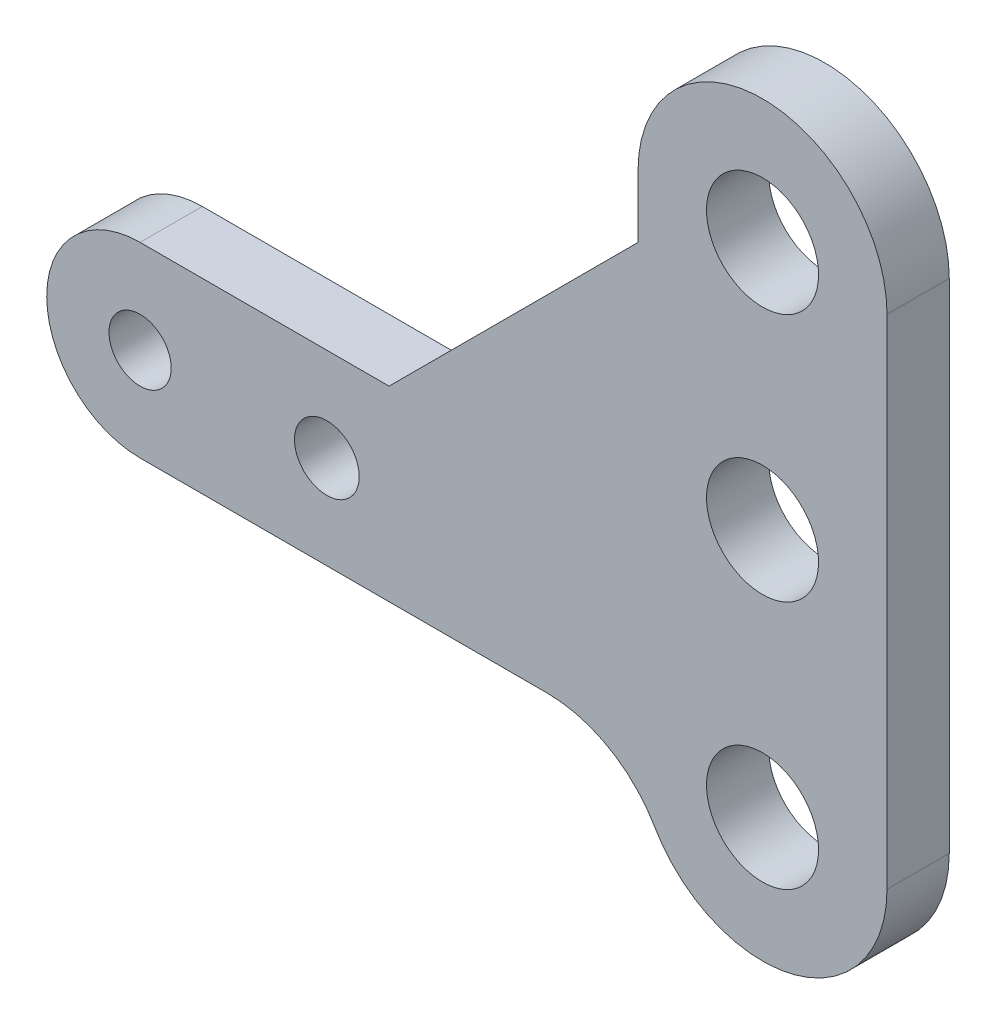
ISO-10303-21;
HEADER;
FILE_DESCRIPTION(('STEP AP214'),'2;1');
FILE_NAME('part.step','',(''),(''),'','','');
FILE_SCHEMA(('AUTOMOTIVE_DESIGN { 1 0 10303 214 1 1 1 1 }'));
ENDSEC;
DATA;
#1=APPLICATION_CONTEXT('core data for automotive mechanical design processes');
#2=APPLICATION_PROTOCOL_DEFINITION('international standard','automotive_design',2000,#1);
#3=PRODUCT_CONTEXT('',#1,'mechanical');
#4=PRODUCT('Part','Part','',(#3));
#5=PRODUCT_RELATED_PRODUCT_CATEGORY('part','',(#4));
#6=PRODUCT_DEFINITION_FORMATION('','',#4);
#7=PRODUCT_DEFINITION_CONTEXT('part definition',#1,'design');
#8=PRODUCT_DEFINITION('design','',#6,#7);
#9=PRODUCT_DEFINITION_SHAPE('','',#8);
#10=(LENGTH_UNIT() NAMED_UNIT(*) SI_UNIT(.MILLI.,.METRE.));
#11=(NAMED_UNIT(*) PLANE_ANGLE_UNIT() SI_UNIT($,.RADIAN.));
#12=(NAMED_UNIT(*) SI_UNIT($,.STERADIAN.) SOLID_ANGLE_UNIT());
#13=UNCERTAINTY_MEASURE_WITH_UNIT(LENGTH_MEASURE(1.E-05),#10,'distance_accuracy_value','');
#14=(GEOMETRIC_REPRESENTATION_CONTEXT(3) GLOBAL_UNCERTAINTY_ASSIGNED_CONTEXT((#13)) GLOBAL_UNIT_ASSIGNED_CONTEXT((#10,
#11,#12)) REPRESENTATION_CONTEXT('',''));
#15=CARTESIAN_POINT('',(0.,0.,0.));
#16=DIRECTION('',(0.,0.,1.));
#17=DIRECTION('',(1.,0.,0.));
#18=AXIS2_PLACEMENT_3D('',#15,#16,#17);
#19=CARTESIAN_POINT('',(-15.,0.,-5.));
#20=DIRECTION('',(0.,0.,1.));
#21=DIRECTION('',(1.,0.,0.));
#22=AXIS2_PLACEMENT_3D('',#19,#20,#21);
#23=CYLINDRICAL_SURFACE('',#22,7.5);
#24=CARTESIAN_POINT('',(-15.,0.,0.));
#25=DIRECTION('',(0.,0.,1.));
#26=DIRECTION('',(1.,0.,0.));
#27=AXIS2_PLACEMENT_3D('',#24,#25,#26);
#28=CIRCLE('',#27,7.5);
#29=CARTESIAN_POINT('',(-15.,7.5,0.));
#30=VERTEX_POINT('',#29);
#31=CARTESIAN_POINT('',(-15.,-7.5,0.));
#32=VERTEX_POINT('',#31);
#33=EDGE_CURVE('E153',#30,#32,#28,.T.);
#34=ORIENTED_EDGE('',*,*,#33,.F.);
#35=DIRECTION('',(0.,0.,1.));
#36=VECTOR('',#35,1.);
#37=CARTESIAN_POINT('',(-15.,7.5,-5.));
#38=LINE('',#37,#36);
#39=CARTESIAN_POINT('',(-15.,7.5,-5.));
#40=VERTEX_POINT('',#39);
#41=EDGE_CURVE('E133',#40,#30,#38,.T.);
#42=ORIENTED_EDGE('',*,*,#41,.F.);
#43=CARTESIAN_POINT('',(-15.,0.,-5.));
#44=DIRECTION('',(0.,0.,1.));
#45=DIRECTION('',(1.,0.,0.));
#46=AXIS2_PLACEMENT_3D('',#43,#44,#45);
#47=CIRCLE('',#46,7.5);
#48=CARTESIAN_POINT('',(-15.,-7.5,-5.));
#49=VERTEX_POINT('',#48);
#50=EDGE_CURVE('E127',#40,#49,#47,.T.);
#51=ORIENTED_EDGE('',*,*,#50,.T.);
#52=DIRECTION('',(0.,0.,1.));
#53=VECTOR('',#52,1.);
#54=CARTESIAN_POINT('',(-15.,-7.5,-5.));
#55=LINE('',#54,#53);
#56=EDGE_CURVE('E109',#49,#32,#55,.T.);
#57=ORIENTED_EDGE('',*,*,#56,.T.);
#58=EDGE_LOOP('',(#34,#42,#51,#57));
#59=FACE_BOUND('',#58,.T.);
#60=ADVANCED_FACE('F40',(#59),#23,.T.);
#61=CARTESIAN_POINT('',(-15.,7.5,-5.));
#62=DIRECTION('',(0.,1.,0.));
#63=DIRECTION('',(0.,0.,1.));
#64=AXIS2_PLACEMENT_3D('',#61,#62,#63);
#65=PLANE('',#64);
#66=DIRECTION('',(-1.,0.,0.));
#67=VECTOR('',#66,1.);
#68=CARTESIAN_POINT('',(-15.,7.5,0.));
#69=LINE('',#68,#67);
#70=CARTESIAN_POINT('',(5.00000000000011,7.5,0.));
#71=VERTEX_POINT('',#70);
#72=EDGE_CURVE('E134',#71,#30,#69,.T.);
#73=ORIENTED_EDGE('',*,*,#72,.F.);
#74=DIRECTION('',(0.,0.,-1.));
#75=VECTOR('',#74,1.);
#76=CARTESIAN_POINT('',(5.00000000000011,7.5,-5.));
#77=LINE('',#76,#75);
#78=CARTESIAN_POINT('',(5.00000000000011,7.5,-5.));
#79=VERTEX_POINT('',#78);
#80=EDGE_CURVE('E177',#71,#79,#77,.T.);
#81=ORIENTED_EDGE('',*,*,#80,.T.);
#82=DIRECTION('',(-1.,0.,0.));
#83=VECTOR('',#82,1.);
#84=CARTESIAN_POINT('',(25.,7.5,-5.));
#85=LINE('',#84,#83);
#86=EDGE_CURVE('E121',#79,#40,#85,.T.);
#87=ORIENTED_EDGE('',*,*,#86,.T.);
#88=ORIENTED_EDGE('',*,*,#41,.T.);
#89=EDGE_LOOP('',(#73,#81,#87,#88));
#90=FACE_BOUND('',#89,.T.);
#91=ADVANCED_FACE('F190',(#90),#65,.T.);
#92=CARTESIAN_POINT('',(25.,32.5,-5.));
#93=DIRECTION('',(-1.,0.,0.));
#94=DIRECTION('',(0.,-1.,0.));
#95=AXIS2_PLACEMENT_3D('',#92,#93,#94);
#96=PLANE('',#95);
#97=DIRECTION('',(0.,-1.,0.));
#98=VECTOR('',#97,1.);
#99=CARTESIAN_POINT('',(25.,32.5,-5.));
#100=LINE('',#99,#98);
#101=CARTESIAN_POINT('',(25.,32.5,-5.));
#102=VERTEX_POINT('',#101);
#103=CARTESIAN_POINT('',(25.,27.5000000000001,-5.));
#104=VERTEX_POINT('',#103);
#105=EDGE_CURVE('E149',#102,#104,#100,.T.);
#106=ORIENTED_EDGE('',*,*,#105,.T.);
#107=DIRECTION('',(0.,0.,1.));
#108=VECTOR('',#107,1.);
#109=CARTESIAN_POINT('',(25.,27.5000000000001,0.));
#110=LINE('',#109,#108);
#111=CARTESIAN_POINT('',(25.,27.5000000000001,0.));
#112=VERTEX_POINT('',#111);
#113=EDGE_CURVE('E168',#104,#112,#110,.T.);
#114=ORIENTED_EDGE('',*,*,#113,.T.);
#115=DIRECTION('',(0.,-1.,0.));
#116=VECTOR('',#115,1.);
#117=CARTESIAN_POINT('',(25.,32.5,0.));
#118=LINE('',#117,#116);
#119=CARTESIAN_POINT('',(25.,32.5,0.));
#120=VERTEX_POINT('',#119);
#121=EDGE_CURVE('E136',#120,#112,#118,.T.);
#122=ORIENTED_EDGE('',*,*,#121,.F.);
#123=DIRECTION('',(0.,0.,1.));
#124=VECTOR('',#123,1.);
#125=CARTESIAN_POINT('',(25.,32.5,-5.));
#126=LINE('',#125,#124);
#127=EDGE_CURVE('E169',#102,#120,#126,.T.);
#128=ORIENTED_EDGE('',*,*,#127,.F.);
#129=EDGE_LOOP('',(#106,#114,#122,#128));
#130=FACE_BOUND('',#129,.T.);
#131=ADVANCED_FACE('F198',(#130),#96,.T.);
#132=CARTESIAN_POINT('',(35.,32.5,-5.));
#133=DIRECTION('',(0.,0.,1.));
#134=DIRECTION('',(1.,0.,0.));
#135=AXIS2_PLACEMENT_3D('',#132,#133,#134);
#136=CYLINDRICAL_SURFACE('',#135,10.);
#137=CARTESIAN_POINT('',(35.,32.5,0.));
#138=DIRECTION('',(0.,0.,1.));
#139=DIRECTION('',(1.,0.,0.));
#140=AXIS2_PLACEMENT_3D('',#137,#138,#139);
#141=CIRCLE('',#140,10.);
#142=CARTESIAN_POINT('',(45.,32.5,0.));
#143=VERTEX_POINT('',#142);
#144=EDGE_CURVE('E162',#143,#120,#141,.T.);
#145=ORIENTED_EDGE('',*,*,#144,.F.);
#146=DIRECTION('',(0.,0.,1.));
#147=VECTOR('',#146,1.);
#148=CARTESIAN_POINT('',(45.,32.5,-5.));
#149=LINE('',#148,#147);
#150=CARTESIAN_POINT('',(45.,32.5,-5.));
#151=VERTEX_POINT('',#150);
#152=EDGE_CURVE('E171',#151,#143,#149,.T.);
#153=ORIENTED_EDGE('',*,*,#152,.F.);
#154=CARTESIAN_POINT('',(35.,32.5,-5.));
#155=DIRECTION('',(0.,0.,1.));
#156=DIRECTION('',(1.,0.,0.));
#157=AXIS2_PLACEMENT_3D('',#154,#155,#156);
#158=CIRCLE('',#157,10.);
#159=EDGE_CURVE('E146',#151,#102,#158,.T.);
#160=ORIENTED_EDGE('',*,*,#159,.T.);
#161=ORIENTED_EDGE('',*,*,#127,.T.);
#162=EDGE_LOOP('',(#145,#153,#160,#161));
#163=FACE_BOUND('',#162,.T.);
#164=ADVANCED_FACE('F202',(#163),#136,.T.);
#165=CARTESIAN_POINT('',(45.,-7.5,-5.));
#166=DIRECTION('',(1.,0.,0.));
#167=DIRECTION('',(0.,1.,0.));
#168=AXIS2_PLACEMENT_3D('',#165,#166,#167);
#169=PLANE('',#168);
#170=DIRECTION('',(0.,1.,0.));
#171=VECTOR('',#170,1.);
#172=CARTESIAN_POINT('',(45.,-7.5,0.));
#173=LINE('',#172,#171);
#174=CARTESIAN_POINT('',(45.,-7.5,0.));
#175=VERTEX_POINT('',#174);
#176=EDGE_CURVE('E159',#175,#143,#173,.T.);
#177=ORIENTED_EDGE('',*,*,#176,.F.);
#178=DIRECTION('',(0.,0.,1.));
#179=VECTOR('',#178,1.);
#180=CARTESIAN_POINT('',(45.,-7.5,-5.));
#181=LINE('',#180,#179);
#182=CARTESIAN_POINT('',(45.,-7.5,-5.));
#183=VERTEX_POINT('',#182);
#184=EDGE_CURVE('E120',#183,#175,#181,.T.);
#185=ORIENTED_EDGE('',*,*,#184,.F.);
#186=DIRECTION('',(0.,1.,0.));
#187=VECTOR('',#186,1.);
#188=CARTESIAN_POINT('',(45.,-7.5,-5.));
#189=LINE('',#188,#187);
#190=EDGE_CURVE('E143',#183,#151,#189,.T.);
#191=ORIENTED_EDGE('',*,*,#190,.T.);
#192=ORIENTED_EDGE('',*,*,#152,.T.);
#193=EDGE_LOOP('',(#177,#185,#191,#192));
#194=FACE_BOUND('',#193,.T.);
#195=ADVANCED_FACE('F207',(#194),#169,.T.);
#196=CARTESIAN_POINT('',(35.,-7.5,-5.));
#197=DIRECTION('',(0.,0.,1.));
#198=DIRECTION('',(1.,0.,0.));
#199=AXIS2_PLACEMENT_3D('',#196,#197,#198);
#200=CYLINDRICAL_SURFACE('',#199,9.99999999999999);
#201=CARTESIAN_POINT('',(35.,-7.5,0.));
#202=DIRECTION('',(0.,0.,1.));
#203=DIRECTION('',(1.,0.,0.));
#204=AXIS2_PLACEMENT_3D('',#201,#202,#203);
#205=CIRCLE('',#204,9.99999999999999);
#206=CARTESIAN_POINT('',(26.3397459621557,-12.5,0.));
#207=VERTEX_POINT('',#206);
#208=EDGE_CURVE('E157',#207,#175,#205,.T.);
#209=ORIENTED_EDGE('',*,*,#208,.F.);
#210=DIRECTION('',(0.,0.,1.));
#211=VECTOR('',#210,1.);
#212=CARTESIAN_POINT('',(26.3397459621557,-12.5,-5.));
#213=LINE('',#212,#211);
#214=CARTESIAN_POINT('',(26.3397459621557,-12.5,-5.));
#215=VERTEX_POINT('',#214);
#216=EDGE_CURVE('E55',#207,#215,#213,.F.);
#217=ORIENTED_EDGE('',*,*,#216,.T.);
#218=CARTESIAN_POINT('',(35.,-7.5,-5.));
#219=DIRECTION('',(0.,0.,1.));
#220=DIRECTION('',(1.,0.,0.));
#221=AXIS2_PLACEMENT_3D('',#218,#219,#220);
#222=CIRCLE('',#221,9.99999999999999);
#223=EDGE_CURVE('E129',#215,#183,#222,.T.);
#224=ORIENTED_EDGE('',*,*,#223,.T.);
#225=ORIENTED_EDGE('',*,*,#184,.T.);
#226=EDGE_LOOP('',(#209,#217,#224,#225));
#227=FACE_BOUND('',#226,.T.);
#228=ADVANCED_FACE('F208',(#227),#200,.T.);
#229=CARTESIAN_POINT('',(15.,-7.5,-5.));
#230=DIRECTION('',(0.,-1.,0.));
#231=DIRECTION('',(1.,0.,0.));
#232=AXIS2_PLACEMENT_3D('',#229,#230,#231);
#233=PLANE('',#232);
#234=DIRECTION('',(1.,0.,0.));
#235=VECTOR('',#234,1.);
#236=CARTESIAN_POINT('',(-15.,-7.5,-5.));
#237=LINE('',#236,#235);
#238=CARTESIAN_POINT('',(17.6794919243113,-7.5,-5.));
#239=VERTEX_POINT('',#238);
#240=EDGE_CURVE('E113',#49,#239,#237,.T.);
#241=ORIENTED_EDGE('',*,*,#240,.T.);
#242=DIRECTION('',(0.,0.,-1.));
#243=VECTOR('',#242,1.);
#244=CARTESIAN_POINT('',(17.6794919243113,-7.5,0.));
#245=LINE('',#244,#243);
#246=CARTESIAN_POINT('',(17.6794919243113,-7.5,0.));
#247=VERTEX_POINT('',#246);
#248=EDGE_CURVE('E183',#239,#247,#245,.F.);
#249=ORIENTED_EDGE('',*,*,#248,.T.);
#250=DIRECTION('',(1.,0.,0.));
#251=VECTOR('',#250,1.);
#252=CARTESIAN_POINT('',(15.,-7.5,0.));
#253=LINE('',#252,#251);
#254=EDGE_CURVE('E115',#32,#247,#253,.T.);
#255=ORIENTED_EDGE('',*,*,#254,.F.);
#256=ORIENTED_EDGE('',*,*,#56,.F.);
#257=EDGE_LOOP('',(#241,#249,#255,#256));
#258=FACE_BOUND('',#257,.T.);
#259=ADVANCED_FACE('F111',(#258),#233,.T.);
#260=CARTESIAN_POINT('',(-15.,0.,-5.));
#261=DIRECTION('',(0.,0.,1.));
#262=DIRECTION('',(1.,0.,0.));
#263=AXIS2_PLACEMENT_3D('',#260,#261,#262);
#264=PLANE('',#263);
#265=CARTESIAN_POINT('',(35.,-7.5,-5.));
#266=DIRECTION('',(0.,0.,1.));
#267=DIRECTION('',(1.,0.,0.));
#268=AXIS2_PLACEMENT_3D('',#265,#266,#267);
#269=CIRCLE('',#268,4.5);
#270=CARTESIAN_POINT('',(39.5,-7.5,-5.));
#271=VERTEX_POINT('',#270);
#272=EDGE_CURVE('E266',#271,#271,#269,.T.);
#273=ORIENTED_EDGE('',*,*,#272,.T.);
#274=EDGE_LOOP('',(#273));
#275=FACE_BOUND('',#274,.T.);
#276=CARTESIAN_POINT('',(35.,32.5,-5.));
#277=DIRECTION('',(0.,0.,1.));
#278=DIRECTION('',(1.,0.,0.));
#279=AXIS2_PLACEMENT_3D('',#276,#277,#278);
#280=CIRCLE('',#279,4.50000000000001);
#281=CARTESIAN_POINT('',(39.5,32.5,-5.));
#282=VERTEX_POINT('',#281);
#283=EDGE_CURVE('E268',#282,#282,#280,.T.);
#284=ORIENTED_EDGE('',*,*,#283,.T.);
#285=EDGE_LOOP('',(#284));
#286=FACE_BOUND('',#285,.T.);
#287=CARTESIAN_POINT('',(35.,12.5,-5.));
#288=DIRECTION('',(0.,0.,1.));
#289=DIRECTION('',(1.,0.,0.));
#290=AXIS2_PLACEMENT_3D('',#287,#288,#289);
#291=CIRCLE('',#290,4.5);
#292=CARTESIAN_POINT('',(39.5,12.5,-5.));
#293=VERTEX_POINT('',#292);
#294=EDGE_CURVE('E274',#293,#293,#291,.T.);
#295=ORIENTED_EDGE('',*,*,#294,.T.);
#296=EDGE_LOOP('',(#295));
#297=FACE_BOUND('',#296,.T.);
#298=CARTESIAN_POINT('',(-15.,0.,-5.));
#299=DIRECTION('',(0.,0.,1.));
#300=DIRECTION('',(1.,0.,0.));
#301=AXIS2_PLACEMENT_3D('',#298,#299,#300);
#302=CIRCLE('',#301,2.5);
#303=CARTESIAN_POINT('',(-12.5,0.,-5.));
#304=VERTEX_POINT('',#303);
#305=EDGE_CURVE('E271',#304,#304,#302,.T.);
#306=ORIENTED_EDGE('',*,*,#305,.T.);
#307=EDGE_LOOP('',(#306));
#308=FACE_BOUND('',#307,.T.);
#309=CARTESIAN_POINT('',(0.,0.,-5.));
#310=DIRECTION('',(0.,0.,1.));
#311=DIRECTION('',(1.,0.,0.));
#312=AXIS2_PLACEMENT_3D('',#309,#310,#311);
#313=CIRCLE('',#312,2.6);
#314=CARTESIAN_POINT('',(2.6,0.,-5.));
#315=VERTEX_POINT('',#314);
#316=EDGE_CURVE('E155',#315,#315,#313,.T.);
#317=ORIENTED_EDGE('',*,*,#316,.T.);
#318=EDGE_LOOP('',(#317));
#319=FACE_BOUND('',#318,.T.);
#320=ORIENTED_EDGE('',*,*,#50,.F.);
#321=ORIENTED_EDGE('',*,*,#86,.F.);
#322=DIRECTION('',(-0.707106781186544,-0.707106781186551,0.));
#323=VECTOR('',#322,1.);
#324=CARTESIAN_POINT('',(-8.74999999999984,-6.2500000000001,-5.));
#325=LINE('',#324,#323);
#326=EDGE_CURVE('E181',#79,#104,#325,.F.);
#327=ORIENTED_EDGE('',*,*,#326,.T.);
#328=ORIENTED_EDGE('',*,*,#105,.F.);
#329=ORIENTED_EDGE('',*,*,#159,.F.);
#330=ORIENTED_EDGE('',*,*,#190,.F.);
#331=ORIENTED_EDGE('',*,*,#223,.F.);
#332=CARTESIAN_POINT('',(17.6794919243113,-17.5,-5.));
#333=DIRECTION('',(0.,0.,1.));
#334=DIRECTION('',(1.,0.,0.));
#335=AXIS2_PLACEMENT_3D('',#332,#333,#334);
#336=CIRCLE('',#335,10.);
#337=EDGE_CURVE('E11',#215,#239,#336,.T.);
#338=ORIENTED_EDGE('',*,*,#337,.T.);
#339=ORIENTED_EDGE('',*,*,#240,.F.);
#340=EDGE_LOOP('',(#320,#321,#327,#328,#329,#330,#331,#338,#339));
#341=FACE_BOUND('',#340,.T.);
#342=ADVANCED_FACE('F125',(#275,#286,#297,#308,#319,#341),#264,.F.);
#343=CARTESIAN_POINT('',(-15.,0.,0.));
#344=DIRECTION('',(0.,0.,1.));
#345=DIRECTION('',(1.,0.,0.));
#346=AXIS2_PLACEMENT_3D('',#343,#344,#345);
#347=PLANE('',#346);
#348=CARTESIAN_POINT('',(35.,-7.5,0.));
#349=DIRECTION('',(0.,0.,1.));
#350=DIRECTION('',(1.,0.,0.));
#351=AXIS2_PLACEMENT_3D('',#348,#349,#350);
#352=CIRCLE('',#351,4.5);
#353=CARTESIAN_POINT('',(39.5,-7.5,0.));
#354=VERTEX_POINT('',#353);
#355=EDGE_CURVE('E263',#354,#354,#352,.T.);
#356=ORIENTED_EDGE('',*,*,#355,.F.);
#357=EDGE_LOOP('',(#356));
#358=FACE_BOUND('',#357,.T.);
#359=CARTESIAN_POINT('',(35.,32.5,0.));
#360=DIRECTION('',(0.,0.,1.));
#361=DIRECTION('',(1.,0.,0.));
#362=AXIS2_PLACEMENT_3D('',#359,#360,#361);
#363=CIRCLE('',#362,4.50000000000001);
#364=CARTESIAN_POINT('',(39.5,32.5,0.));
#365=VERTEX_POINT('',#364);
#366=EDGE_CURVE('E296',#365,#365,#363,.T.);
#367=ORIENTED_EDGE('',*,*,#366,.F.);
#368=EDGE_LOOP('',(#367));
#369=FACE_BOUND('',#368,.T.);
#370=CARTESIAN_POINT('',(35.,12.5,0.));
#371=DIRECTION('',(0.,0.,1.));
#372=DIRECTION('',(1.,0.,0.));
#373=AXIS2_PLACEMENT_3D('',#370,#371,#372);
#374=CIRCLE('',#373,4.5);
#375=CARTESIAN_POINT('',(39.5,12.5,0.));
#376=VERTEX_POINT('',#375);
#377=EDGE_CURVE('E293',#376,#376,#374,.T.);
#378=ORIENTED_EDGE('',*,*,#377,.F.);
#379=EDGE_LOOP('',(#378));
#380=FACE_BOUND('',#379,.T.);
#381=CARTESIAN_POINT('',(-15.,0.,0.));
#382=DIRECTION('',(0.,0.,1.));
#383=DIRECTION('',(1.,0.,0.));
#384=AXIS2_PLACEMENT_3D('',#381,#382,#383);
#385=CIRCLE('',#384,2.5);
#386=CARTESIAN_POINT('',(-12.5,0.,0.));
#387=VERTEX_POINT('',#386);
#388=EDGE_CURVE('E267',#387,#387,#385,.T.);
#389=ORIENTED_EDGE('',*,*,#388,.F.);
#390=EDGE_LOOP('',(#389));
#391=FACE_BOUND('',#390,.T.);
#392=CARTESIAN_POINT('',(0.,0.,0.));
#393=DIRECTION('',(0.,0.,1.));
#394=DIRECTION('',(1.,0.,0.));
#395=AXIS2_PLACEMENT_3D('',#392,#393,#394);
#396=CIRCLE('',#395,2.6);
#397=CARTESIAN_POINT('',(2.6,0.,0.));
#398=VERTEX_POINT('',#397);
#399=EDGE_CURVE('E139',#398,#398,#396,.T.);
#400=ORIENTED_EDGE('',*,*,#399,.F.);
#401=EDGE_LOOP('',(#400));
#402=FACE_BOUND('',#401,.T.);
#403=ORIENTED_EDGE('',*,*,#33,.T.);
#404=ORIENTED_EDGE('',*,*,#254,.T.);
#405=CARTESIAN_POINT('',(17.6794919243113,-17.5,0.));
#406=DIRECTION('',(0.,0.,1.));
#407=DIRECTION('',(1.,0.,0.));
#408=AXIS2_PLACEMENT_3D('',#405,#406,#407);
#409=CIRCLE('',#408,10.);
#410=EDGE_CURVE('E48',#247,#207,#409,.F.);
#411=ORIENTED_EDGE('',*,*,#410,.T.);
#412=ORIENTED_EDGE('',*,*,#208,.T.);
#413=ORIENTED_EDGE('',*,*,#176,.T.);
#414=ORIENTED_EDGE('',*,*,#144,.T.);
#415=ORIENTED_EDGE('',*,*,#121,.T.);
#416=DIRECTION('',(0.707106781186544,0.707106781186551,0.));
#417=VECTOR('',#416,1.);
#418=CARTESIAN_POINT('',(25.,27.5000000000001,0.));
#419=LINE('',#418,#417);
#420=EDGE_CURVE('E179',#112,#71,#419,.F.);
#421=ORIENTED_EDGE('',*,*,#420,.T.);
#422=ORIENTED_EDGE('',*,*,#72,.T.);
#423=EDGE_LOOP('',(#403,#404,#411,#412,#413,#414,#415,#421,#422));
#424=FACE_BOUND('',#423,.T.);
#425=ADVANCED_FACE('F186',(#358,#369,#380,#391,#402,#424),#347,.T.);
#426=CARTESIAN_POINT('',(0.,0.,-5.));
#427=DIRECTION('',(0.,0.,1.));
#428=DIRECTION('',(1.,0.,0.));
#429=AXIS2_PLACEMENT_3D('',#426,#427,#428);
#430=CYLINDRICAL_SURFACE('',#429,2.6);
#431=ORIENTED_EDGE('',*,*,#316,.F.);
#432=EDGE_LOOP('',(#431));
#433=FACE_BOUND('',#432,.T.);
#434=ORIENTED_EDGE('',*,*,#399,.T.);
#435=EDGE_LOOP('',(#434));
#436=FACE_BOUND('',#435,.T.);
#437=ADVANCED_FACE('F236',(#433,#436),#430,.F.);
#438=CARTESIAN_POINT('',(-15.,0.,-5.));
#439=DIRECTION('',(0.,0.,1.));
#440=DIRECTION('',(1.,0.,0.));
#441=AXIS2_PLACEMENT_3D('',#438,#439,#440);
#442=CYLINDRICAL_SURFACE('',#441,2.5);
#443=ORIENTED_EDGE('',*,*,#305,.F.);
#444=EDGE_LOOP('',(#443));
#445=FACE_BOUND('',#444,.T.);
#446=ORIENTED_EDGE('',*,*,#388,.T.);
#447=EDGE_LOOP('',(#446));
#448=FACE_BOUND('',#447,.T.);
#449=ADVANCED_FACE('F243',(#445,#448),#442,.F.);
#450=CARTESIAN_POINT('',(35.,12.5,-10.));
#451=DIRECTION('',(0.,0.,1.));
#452=DIRECTION('',(1.,0.,0.));
#453=AXIS2_PLACEMENT_3D('',#450,#451,#452);
#454=CYLINDRICAL_SURFACE('',#453,4.5);
#455=ORIENTED_EDGE('',*,*,#377,.T.);
#456=EDGE_LOOP('',(#455));
#457=FACE_BOUND('',#456,.T.);
#458=ORIENTED_EDGE('',*,*,#294,.F.);
#459=EDGE_LOOP('',(#458));
#460=FACE_BOUND('',#459,.T.);
#461=ADVANCED_FACE('F247',(#457,#460),#454,.F.);
#462=CARTESIAN_POINT('',(35.,32.5,-10.));
#463=DIRECTION('',(0.,0.,1.));
#464=DIRECTION('',(1.,0.,0.));
#465=AXIS2_PLACEMENT_3D('',#462,#463,#464);
#466=CYLINDRICAL_SURFACE('',#465,4.50000000000001);
#467=ORIENTED_EDGE('',*,*,#366,.T.);
#468=EDGE_LOOP('',(#467));
#469=FACE_BOUND('',#468,.T.);
#470=ORIENTED_EDGE('',*,*,#283,.F.);
#471=EDGE_LOOP('',(#470));
#472=FACE_BOUND('',#471,.T.);
#473=ADVANCED_FACE('F251',(#469,#472),#466,.F.);
#474=CARTESIAN_POINT('',(35.,-7.5,-10.));
#475=DIRECTION('',(0.,0.,1.));
#476=DIRECTION('',(1.,0.,0.));
#477=AXIS2_PLACEMENT_3D('',#474,#475,#476);
#478=CYLINDRICAL_SURFACE('',#477,4.5);
#479=ORIENTED_EDGE('',*,*,#355,.T.);
#480=EDGE_LOOP('',(#479));
#481=FACE_BOUND('',#480,.T.);
#482=ORIENTED_EDGE('',*,*,#272,.F.);
#483=EDGE_LOOP('',(#482));
#484=FACE_BOUND('',#483,.T.);
#485=ADVANCED_FACE('F213',(#481,#484),#478,.F.);
#486=CARTESIAN_POINT('',(25.,27.5000000000001,-5.));
#487=DIRECTION('',(-0.707106781186551,0.707106781186544,0.));
#488=DIRECTION('',(0.,0.,-1.));
#489=AXIS2_PLACEMENT_3D('',#486,#487,#488);
#490=PLANE('',#489);
#491=ORIENTED_EDGE('',*,*,#326,.F.);
#492=ORIENTED_EDGE('',*,*,#80,.F.);
#493=ORIENTED_EDGE('',*,*,#420,.F.);
#494=ORIENTED_EDGE('',*,*,#113,.F.);
#495=EDGE_LOOP('',(#491,#492,#493,#494));
#496=FACE_BOUND('',#495,.T.);
#497=ADVANCED_FACE('F195',(#496),#490,.T.);
#498=CARTESIAN_POINT('',(17.6794919243113,-17.5,-5.));
#499=DIRECTION('',(0.,0.,1.));
#500=DIRECTION('',(1.,0.,0.));
#501=AXIS2_PLACEMENT_3D('',#498,#499,#500);
#502=CYLINDRICAL_SURFACE('',#501,10.);
#503=ORIENTED_EDGE('',*,*,#337,.F.);
#504=ORIENTED_EDGE('',*,*,#216,.F.);
#505=ORIENTED_EDGE('',*,*,#410,.F.);
#506=ORIENTED_EDGE('',*,*,#248,.F.);
#507=EDGE_LOOP('',(#503,#504,#505,#506));
#508=FACE_BOUND('',#507,.T.);
#509=ADVANCED_FACE('F42',(#508),#502,.F.);
#510=CLOSED_SHELL('',(#60,#91,#131,#164,#195,#228,#259,#342,#425,#437,#449,#461,#473,#485,#497,#509));
#511=MANIFOLD_SOLID_BREP('B2',#510);
#512=ADVANCED_BREP_SHAPE_REPRESENTATION('',(#18,#511),#14);
#513=SHAPE_DEFINITION_REPRESENTATION(#9,#512);
ENDSEC;
END-ISO-10303-21;
